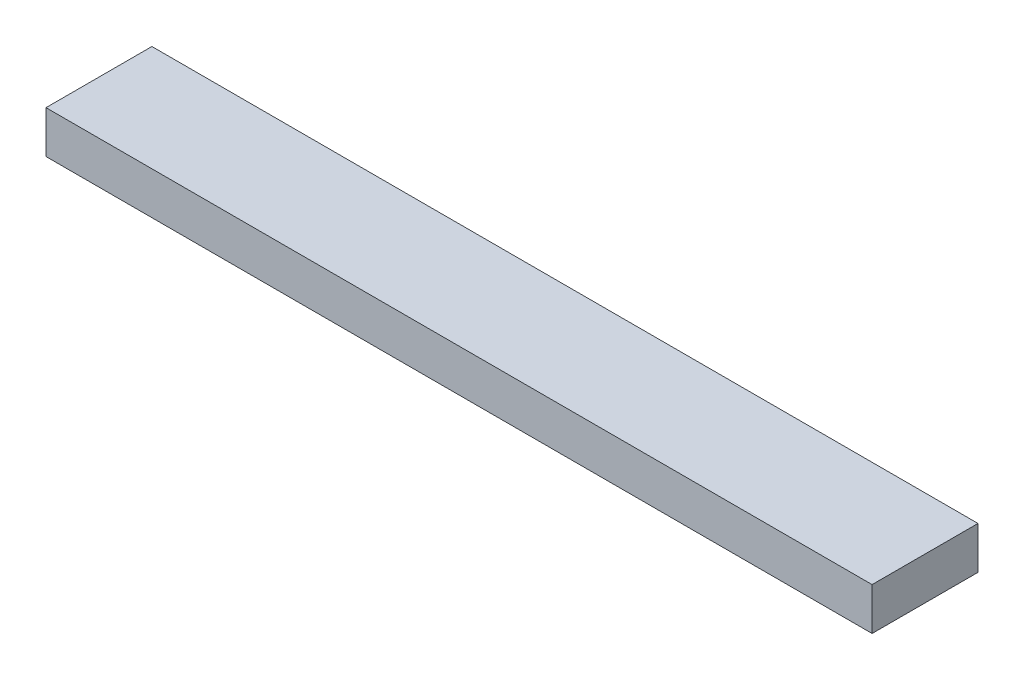
ISO-10303-21;
HEADER;
FILE_DESCRIPTION(('STEP AP214'),'2;1');
FILE_NAME('part.step','',(''),(''),'','','');
FILE_SCHEMA(('AUTOMOTIVE_DESIGN { 1 0 10303 214 1 1 1 1 }'));
ENDSEC;
DATA;
#1=APPLICATION_CONTEXT('core data for automotive mechanical design processes');
#2=APPLICATION_PROTOCOL_DEFINITION('international standard','automotive_design',2000,#1);
#3=PRODUCT_CONTEXT('',#1,'mechanical');
#4=PRODUCT('Part','Part','',(#3));
#5=PRODUCT_RELATED_PRODUCT_CATEGORY('part','',(#4));
#6=PRODUCT_DEFINITION_FORMATION('','',#4);
#7=PRODUCT_DEFINITION_CONTEXT('part definition',#1,'design');
#8=PRODUCT_DEFINITION('design','',#6,#7);
#9=PRODUCT_DEFINITION_SHAPE('','',#8);
#10=(LENGTH_UNIT() NAMED_UNIT(*) SI_UNIT(.MILLI.,.METRE.));
#11=(NAMED_UNIT(*) PLANE_ANGLE_UNIT() SI_UNIT($,.RADIAN.));
#12=(NAMED_UNIT(*) SI_UNIT($,.STERADIAN.) SOLID_ANGLE_UNIT());
#13=UNCERTAINTY_MEASURE_WITH_UNIT(LENGTH_MEASURE(1.E-05),#10,'distance_accuracy_value','');
#14=(GEOMETRIC_REPRESENTATION_CONTEXT(3) GLOBAL_UNCERTAINTY_ASSIGNED_CONTEXT((#13)) GLOBAL_UNIT_ASSIGNED_CONTEXT((#10,
#11,#12)) REPRESENTATION_CONTEXT('',''));
#15=CARTESIAN_POINT('',(0.,0.,0.));
#16=DIRECTION('',(0.,0.,1.));
#17=DIRECTION('',(1.,0.,0.));
#18=AXIS2_PLACEMENT_3D('',#15,#16,#17);
#19=CARTESIAN_POINT('',(990.6,0.,0.));
#20=DIRECTION('',(0.,0.,-1.));
#21=DIRECTION('',(-1.,0.,0.));
#22=AXIS2_PLACEMENT_3D('',#19,#20,#21);
#23=PLANE('',#22);
#24=DIRECTION('',(0.,-1.,0.));
#25=VECTOR('',#24,1.);
#26=CARTESIAN_POINT('',(0.,0.,0.));
#27=LINE('',#26,#25);
#28=CARTESIAN_POINT('',(0.,50.8,0.));
#29=VERTEX_POINT('',#28);
#30=CARTESIAN_POINT('',(0.,0.,0.));
#31=VERTEX_POINT('',#30);
#32=EDGE_CURVE('E99',#29,#31,#27,.T.);
#33=ORIENTED_EDGE('',*,*,#32,.T.);
#34=DIRECTION('',(-1.,0.,0.));
#35=VECTOR('',#34,1.);
#36=CARTESIAN_POINT('',(990.6,0.,0.));
#37=LINE('',#36,#35);
#38=CARTESIAN_POINT('',(990.6,0.,0.));
#39=VERTEX_POINT('',#38);
#40=EDGE_CURVE('E11',#39,#31,#37,.T.);
#41=ORIENTED_EDGE('',*,*,#40,.F.);
#42=DIRECTION('',(0.,-1.,0.));
#43=VECTOR('',#42,1.);
#44=CARTESIAN_POINT('',(990.6,0.,0.));
#45=LINE('',#44,#43);
#46=CARTESIAN_POINT('',(990.6,50.8,0.));
#47=VERTEX_POINT('',#46);
#48=EDGE_CURVE('E87',#47,#39,#45,.T.);
#49=ORIENTED_EDGE('',*,*,#48,.F.);
#50=DIRECTION('',(-1.,0.,0.));
#51=VECTOR('',#50,1.);
#52=CARTESIAN_POINT('',(990.6,50.8,0.));
#53=LINE('',#52,#51);
#54=EDGE_CURVE('E95',#47,#29,#53,.T.);
#55=ORIENTED_EDGE('',*,*,#54,.T.);
#56=EDGE_LOOP('',(#33,#41,#49,#55));
#57=FACE_BOUND('',#56,.T.);
#58=ADVANCED_FACE('F36',(#57),#23,.F.);
#59=CARTESIAN_POINT('',(990.6,0.,0.));
#60=DIRECTION('',(0.,1.,0.));
#61=DIRECTION('',(0.,0.,1.));
#62=AXIS2_PLACEMENT_3D('',#59,#60,#61);
#63=PLANE('',#62);
#64=DIRECTION('',(0.,0.,-1.));
#65=VECTOR('',#64,1.);
#66=CARTESIAN_POINT('',(0.,0.,0.));
#67=LINE('',#66,#65);
#68=CARTESIAN_POINT('',(0.,0.,-127.));
#69=VERTEX_POINT('',#68);
#70=EDGE_CURVE('E91',#31,#69,#67,.T.);
#71=ORIENTED_EDGE('',*,*,#70,.T.);
#72=DIRECTION('',(-1.,0.,0.));
#73=VECTOR('',#72,1.);
#74=CARTESIAN_POINT('',(990.6,0.,-127.));
#75=LINE('',#74,#73);
#76=CARTESIAN_POINT('',(990.6,0.,-127.));
#77=VERTEX_POINT('',#76);
#78=EDGE_CURVE('E44',#77,#69,#75,.T.);
#79=ORIENTED_EDGE('',*,*,#78,.F.);
#80=DIRECTION('',(0.,0.,-1.));
#81=VECTOR('',#80,1.);
#82=CARTESIAN_POINT('',(990.6,0.,0.));
#83=LINE('',#82,#81);
#84=EDGE_CURVE('E82',#39,#77,#83,.T.);
#85=ORIENTED_EDGE('',*,*,#84,.F.);
#86=ORIENTED_EDGE('',*,*,#40,.T.);
#87=EDGE_LOOP('',(#71,#79,#85,#86));
#88=FACE_BOUND('',#87,.T.);
#89=ADVANCED_FACE('F90',(#88),#63,.F.);
#90=CARTESIAN_POINT('',(990.6,0.,-127.));
#91=DIRECTION('',(0.,0.,1.));
#92=DIRECTION('',(1.,0.,0.));
#93=AXIS2_PLACEMENT_3D('',#90,#91,#92);
#94=PLANE('',#93);
#95=DIRECTION('',(0.,1.,0.));
#96=VECTOR('',#95,1.);
#97=CARTESIAN_POINT('',(0.,0.,-127.));
#98=LINE('',#97,#96);
#99=CARTESIAN_POINT('',(0.,50.8,-127.));
#100=VERTEX_POINT('',#99);
#101=EDGE_CURVE('E69',#69,#100,#98,.T.);
#102=ORIENTED_EDGE('',*,*,#101,.T.);
#103=DIRECTION('',(-1.,0.,0.));
#104=VECTOR('',#103,1.);
#105=CARTESIAN_POINT('',(990.6,50.8,-127.));
#106=LINE('',#105,#104);
#107=CARTESIAN_POINT('',(990.6,50.8,-127.));
#108=VERTEX_POINT('',#107);
#109=EDGE_CURVE('E92',#108,#100,#106,.T.);
#110=ORIENTED_EDGE('',*,*,#109,.F.);
#111=DIRECTION('',(0.,1.,0.));
#112=VECTOR('',#111,1.);
#113=CARTESIAN_POINT('',(990.6,0.,-127.));
#114=LINE('',#113,#112);
#115=EDGE_CURVE('E85',#77,#108,#114,.T.);
#116=ORIENTED_EDGE('',*,*,#115,.F.);
#117=ORIENTED_EDGE('',*,*,#78,.T.);
#118=EDGE_LOOP('',(#102,#110,#116,#117));
#119=FACE_BOUND('',#118,.T.);
#120=ADVANCED_FACE('F93',(#119),#94,.F.);
#121=CARTESIAN_POINT('',(990.6,50.8,0.));
#122=DIRECTION('',(0.,-1.,0.));
#123=DIRECTION('',(0.,0.,-1.));
#124=AXIS2_PLACEMENT_3D('',#121,#122,#123);
#125=PLANE('',#124);
#126=DIRECTION('',(0.,0.,1.));
#127=VECTOR('',#126,1.);
#128=CARTESIAN_POINT('',(0.,50.8,0.));
#129=LINE('',#128,#127);
#130=EDGE_CURVE('E75',#100,#29,#129,.T.);
#131=ORIENTED_EDGE('',*,*,#130,.T.);
#132=ORIENTED_EDGE('',*,*,#54,.F.);
#133=DIRECTION('',(0.,0.,1.));
#134=VECTOR('',#133,1.);
#135=CARTESIAN_POINT('',(990.6,50.8,0.));
#136=LINE('',#135,#134);
#137=EDGE_CURVE('E52',#108,#47,#136,.T.);
#138=ORIENTED_EDGE('',*,*,#137,.F.);
#139=ORIENTED_EDGE('',*,*,#109,.T.);
#140=EDGE_LOOP('',(#131,#132,#138,#139));
#141=FACE_BOUND('',#140,.T.);
#142=ADVANCED_FACE('F106',(#141),#125,.F.);
#143=CARTESIAN_POINT('',(990.6,0.,0.));
#144=DIRECTION('',(-1.,0.,0.));
#145=DIRECTION('',(0.,0.,1.));
#146=AXIS2_PLACEMENT_3D('',#143,#144,#145);
#147=PLANE('',#146);
#148=ORIENTED_EDGE('',*,*,#48,.T.);
#149=ORIENTED_EDGE('',*,*,#84,.T.);
#150=ORIENTED_EDGE('',*,*,#115,.T.);
#151=ORIENTED_EDGE('',*,*,#137,.T.);
#152=EDGE_LOOP('',(#148,#149,#150,#151));
#153=FACE_BOUND('',#152,.T.);
#154=ADVANCED_FACE('F83',(#153),#147,.F.);
#155=CARTESIAN_POINT('',(0.,0.,0.));
#156=DIRECTION('',(-1.,0.,0.));
#157=DIRECTION('',(0.,0.,1.));
#158=AXIS2_PLACEMENT_3D('',#155,#156,#157);
#159=PLANE('',#158);
#160=ORIENTED_EDGE('',*,*,#32,.F.);
#161=ORIENTED_EDGE('',*,*,#130,.F.);
#162=ORIENTED_EDGE('',*,*,#101,.F.);
#163=ORIENTED_EDGE('',*,*,#70,.F.);
#164=EDGE_LOOP('',(#160,#161,#162,#163));
#165=FACE_BOUND('',#164,.T.);
#166=ADVANCED_FACE('F109',(#165),#159,.T.);
#167=CLOSED_SHELL('',(#58,#89,#120,#142,#154,#166));
#168=MANIFOLD_SOLID_BREP('B2',#167);
#169=ADVANCED_BREP_SHAPE_REPRESENTATION('',(#18,#168),#14);
#170=SHAPE_DEFINITION_REPRESENTATION(#9,#169);
ENDSEC;
END-ISO-10303-21;
